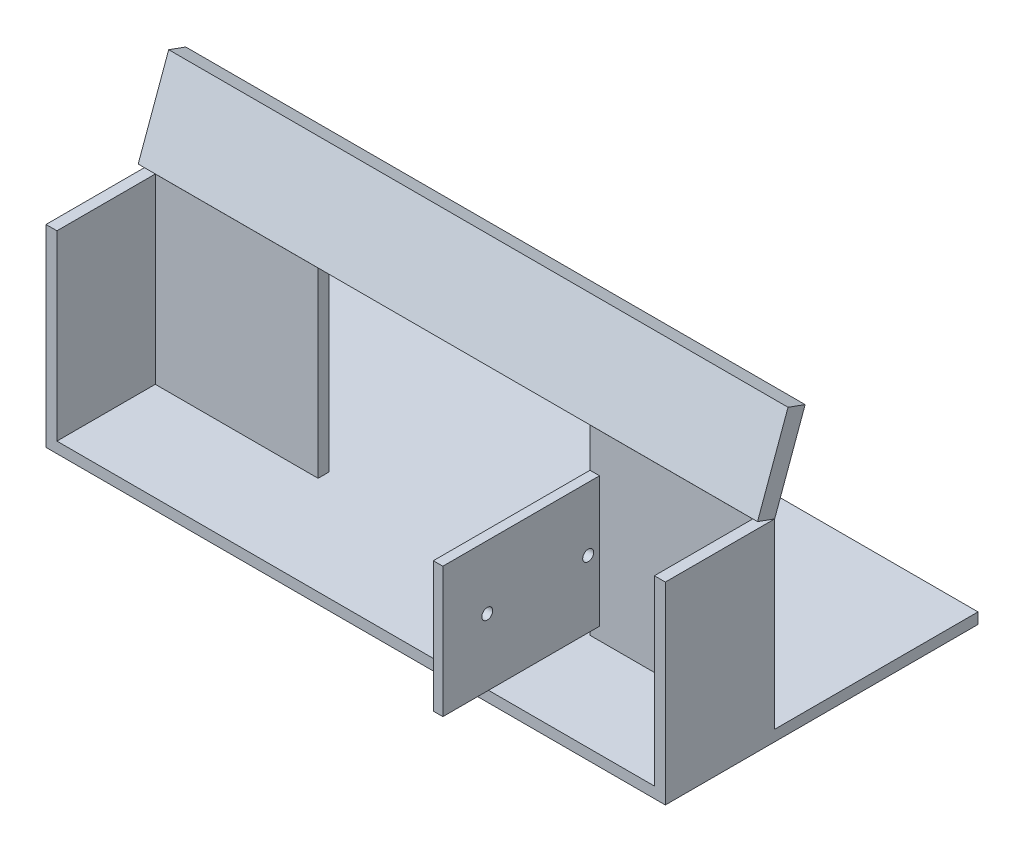
ISO-10303-21;
HEADER;
FILE_DESCRIPTION(('STEP AP214'),'2;1');
FILE_NAME('part.step','',(''),(''),'','','');
FILE_SCHEMA(('AUTOMOTIVE_DESIGN { 1 0 10303 214 1 1 1 1 }'));
ENDSEC;
DATA;
#1=APPLICATION_CONTEXT('core data for automotive mechanical design processes');
#2=APPLICATION_PROTOCOL_DEFINITION('international standard','automotive_design',2000,#1);
#3=PRODUCT_CONTEXT('',#1,'mechanical');
#4=PRODUCT('Part','Part','',(#3));
#5=PRODUCT_RELATED_PRODUCT_CATEGORY('part','',(#4));
#6=PRODUCT_DEFINITION_FORMATION('','',#4);
#7=PRODUCT_DEFINITION_CONTEXT('part definition',#1,'design');
#8=PRODUCT_DEFINITION('design','',#6,#7);
#9=PRODUCT_DEFINITION_SHAPE('','',#8);
#10=(LENGTH_UNIT() NAMED_UNIT(*) SI_UNIT(.MILLI.,.METRE.));
#11=(NAMED_UNIT(*) PLANE_ANGLE_UNIT() SI_UNIT($,.RADIAN.));
#12=(NAMED_UNIT(*) SI_UNIT($,.STERADIAN.) SOLID_ANGLE_UNIT());
#13=UNCERTAINTY_MEASURE_WITH_UNIT(LENGTH_MEASURE(1.E-05),#10,'distance_accuracy_value','');
#14=(GEOMETRIC_REPRESENTATION_CONTEXT(3) GLOBAL_UNCERTAINTY_ASSIGNED_CONTEXT((#13)) GLOBAL_UNIT_ASSIGNED_CONTEXT((#10,
#11,#12)) REPRESENTATION_CONTEXT('',''));
#15=CARTESIAN_POINT('',(0.,0.,0.));
#16=DIRECTION('',(0.,0.,1.));
#17=DIRECTION('',(1.,0.,0.));
#18=AXIS2_PLACEMENT_3D('',#15,#16,#17);
#19=CARTESIAN_POINT('',(85.,51.7101007166283,-10.3015368960705));
#20=DIRECTION('',(-1.,0.,0.));
#21=DIRECTION('',(0.,-1.,0.));
#22=AXIS2_PLACEMENT_3D('',#19,#20,#21);
#23=PLANE('',#22);
#24=DIRECTION('',(0.,0.939692620785908,-0.342020143325669));
#25=VECTOR('',#24,1.);
#26=CARTESIAN_POINT('',(85.,50.,-15.));
#27=LINE('',#26,#25);
#28=CARTESIAN_POINT('',(85.,50.,-15.));
#29=VERTEX_POINT('',#28);
#30=CARTESIAN_POINT('',(85.,72.9997961324536,-23.371241186404));
#31=VERTEX_POINT('',#30);
#32=EDGE_CURVE('E108',#29,#31,#27,.T.);
#33=ORIENTED_EDGE('',*,*,#32,.T.);
#34=DIRECTION('',(0.,-0.342020143325669,-0.939692620785908));
#35=VECTOR('',#34,1.);
#36=CARTESIAN_POINT('',(85.,72.9997961324536,-23.371241186404));
#37=LINE('',#36,#35);
#38=CARTESIAN_POINT('',(85.,74.7098968490819,-18.6727780824745));
#39=VERTEX_POINT('',#38);
#40=EDGE_CURVE('E100',#39,#31,#37,.T.);
#41=ORIENTED_EDGE('',*,*,#40,.F.);
#42=DIRECTION('',(0.,0.939692620785908,-0.342020143325669));
#43=VECTOR('',#42,1.);
#44=CARTESIAN_POINT('',(85.,51.7101007166283,-10.3015368960705));
#45=LINE('',#44,#43);
#46=CARTESIAN_POINT('',(85.,51.7101007166283,-10.3015368960705));
#47=VERTEX_POINT('',#46);
#48=EDGE_CURVE('E91',#47,#39,#45,.T.);
#49=ORIENTED_EDGE('',*,*,#48,.F.);
#50=DIRECTION('',(0.,-0.342020143325669,-0.939692620785908));
#51=VECTOR('',#50,1.);
#52=CARTESIAN_POINT('',(85.,51.7101007166283,-10.3015368960705));
#53=LINE('',#52,#51);
#54=EDGE_CURVE('E53',#47,#29,#53,.T.);
#55=ORIENTED_EDGE('',*,*,#54,.T.);
#56=EDGE_LOOP('',(#33,#41,#49,#55));
#57=FACE_BOUND('',#56,.T.);
#58=ADVANCED_FACE('F45',(#57),#23,.F.);
#59=CARTESIAN_POINT('',(-85.,51.7101007166283,-10.3015368960705));
#60=DIRECTION('',(1.,0.,0.));
#61=DIRECTION('',(0.,1.,0.));
#62=AXIS2_PLACEMENT_3D('',#59,#60,#61);
#63=PLANE('',#62);
#64=DIRECTION('',(0.,-0.939692620785908,0.34202014332567));
#65=VECTOR('',#64,1.);
#66=CARTESIAN_POINT('',(-85.,50.,-15.));
#67=LINE('',#66,#65);
#68=CARTESIAN_POINT('',(-85.,72.9997961324536,-23.371241186404));
#69=VERTEX_POINT('',#68);
#70=CARTESIAN_POINT('',(-85.,50.,-15.));
#71=VERTEX_POINT('',#70);
#72=EDGE_CURVE('E72',#69,#71,#67,.T.);
#73=ORIENTED_EDGE('',*,*,#72,.T.);
#74=DIRECTION('',(0.,-0.342020143325669,-0.939692620785908));
#75=VECTOR('',#74,1.);
#76=CARTESIAN_POINT('',(-85.,51.7101007166283,-10.3015368960705));
#77=LINE('',#76,#75);
#78=CARTESIAN_POINT('',(-85.,51.7101007166283,-10.3015368960705));
#79=VERTEX_POINT('',#78);
#80=EDGE_CURVE('E12',#79,#71,#77,.T.);
#81=ORIENTED_EDGE('',*,*,#80,.F.);
#82=DIRECTION('',(0.,-0.939692620785908,0.34202014332567));
#83=VECTOR('',#82,1.);
#84=CARTESIAN_POINT('',(-85.,51.7101007166283,-10.3015368960705));
#85=LINE('',#84,#83);
#86=CARTESIAN_POINT('',(-85.,74.7098968490819,-18.6727780824745));
#87=VERTEX_POINT('',#86);
#88=EDGE_CURVE('E86',#87,#79,#85,.T.);
#89=ORIENTED_EDGE('',*,*,#88,.F.);
#90=DIRECTION('',(0.,0.342020143325669,0.939692620785908));
#91=VECTOR('',#90,1.);
#92=CARTESIAN_POINT('',(-85.,72.9997961324536,-23.371241186404));
#93=LINE('',#92,#91);
#94=EDGE_CURVE('E90',#69,#87,#93,.T.);
#95=ORIENTED_EDGE('',*,*,#94,.F.);
#96=EDGE_LOOP('',(#73,#81,#89,#95));
#97=FACE_BOUND('',#96,.T.);
#98=ADVANCED_FACE('F88',(#97),#63,.F.);
#99=CARTESIAN_POINT('',(85.,51.7101007166283,-10.3015368960705));
#100=DIRECTION('',(0.,0.939692620785908,-0.342020143325669));
#101=DIRECTION('',(0.,0.342020143325669,0.939692620785908));
#102=AXIS2_PLACEMENT_3D('',#99,#100,#101);
#103=PLANE('',#102);
#104=DIRECTION('',(1.,0.,0.));
#105=VECTOR('',#104,1.);
#106=CARTESIAN_POINT('',(85.,50.,-15.));
#107=LINE('',#106,#105);
#108=EDGE_CURVE('E109',#71,#29,#107,.T.);
#109=ORIENTED_EDGE('',*,*,#108,.T.);
#110=ORIENTED_EDGE('',*,*,#54,.F.);
#111=DIRECTION('',(1.,0.,0.));
#112=VECTOR('',#111,1.);
#113=CARTESIAN_POINT('',(85.,51.7101007166283,-10.3015368960705));
#114=LINE('',#113,#112);
#115=EDGE_CURVE('E61',#79,#47,#114,.T.);
#116=ORIENTED_EDGE('',*,*,#115,.F.);
#117=ORIENTED_EDGE('',*,*,#80,.T.);
#118=EDGE_LOOP('',(#109,#110,#116,#117));
#119=FACE_BOUND('',#118,.T.);
#120=ADVANCED_FACE('F119',(#119),#103,.F.);
#121=CARTESIAN_POINT('',(0.,2.73808256600486,7.52282002270072));
#122=DIRECTION('',(0.,0.342020143325669,0.939692620785908));
#123=DIRECTION('',(0.,-0.939692620785908,0.342020143325669));
#124=AXIS2_PLACEMENT_3D('',#121,#122,#123);
#125=PLANE('',#124);
#126=ORIENTED_EDGE('',*,*,#48,.T.);
#127=DIRECTION('',(1.,0.,0.));
#128=VECTOR('',#127,1.);
#129=CARTESIAN_POINT('',(-85.,74.7098968490819,-18.6727780824745));
#130=LINE('',#129,#128);
#131=EDGE_CURVE('E94',#87,#39,#130,.T.);
#132=ORIENTED_EDGE('',*,*,#131,.F.);
#133=ORIENTED_EDGE('',*,*,#88,.T.);
#134=ORIENTED_EDGE('',*,*,#115,.T.);
#135=EDGE_LOOP('',(#126,#132,#133,#134));
#136=FACE_BOUND('',#135,.T.);
#137=ADVANCED_FACE('F95',(#136),#125,.T.);
#138=CARTESIAN_POINT('',(0.,1.02798184937652,2.82435691877117));
#139=DIRECTION('',(0.,0.342020143325669,0.939692620785908));
#140=DIRECTION('',(0.,-0.939692620785908,0.342020143325669));
#141=AXIS2_PLACEMENT_3D('',#138,#139,#140);
#142=PLANE('',#141);
#143=ORIENTED_EDGE('',*,*,#32,.F.);
#144=ORIENTED_EDGE('',*,*,#108,.F.);
#145=ORIENTED_EDGE('',*,*,#72,.F.);
#146=DIRECTION('',(-1.,0.,0.));
#147=VECTOR('',#146,1.);
#148=CARTESIAN_POINT('',(-85.,72.9997961324536,-23.371241186404));
#149=LINE('',#148,#147);
#150=EDGE_CURVE('E103',#31,#69,#149,.T.);
#151=ORIENTED_EDGE('',*,*,#150,.F.);
#152=EDGE_LOOP('',(#143,#144,#145,#151));
#153=FACE_BOUND('',#152,.T.);
#154=ADVANCED_FACE('F118',(#153),#142,.F.);
#155=CARTESIAN_POINT('',(0.,71.9718142830771,-26.1955981051752));
#156=DIRECTION('',(0.,0.939692620785908,-0.342020143325669));
#157=DIRECTION('',(0.,0.342020143325669,0.939692620785908));
#158=AXIS2_PLACEMENT_3D('',#155,#156,#157);
#159=PLANE('',#158);
#160=ORIENTED_EDGE('',*,*,#94,.T.);
#161=ORIENTED_EDGE('',*,*,#131,.T.);
#162=ORIENTED_EDGE('',*,*,#40,.T.);
#163=ORIENTED_EDGE('',*,*,#150,.T.);
#164=EDGE_LOOP('',(#160,#161,#162,#163));
#165=FACE_BOUND('',#164,.T.);
#166=ADVANCED_FACE('F102',(#165),#159,.T.);
#167=CLOSED_SHELL('',(#58,#98,#120,#137,#154,#166));
#168=MANIFOLD_SOLID_BREP('B2',#167);
#169=CARTESIAN_POINT('',(-82.,50.,-12.));
#170=DIRECTION('',(0.,0.,1.));
#171=DIRECTION('',(1.,0.,0.));
#172=AXIS2_PLACEMENT_3D('',#169,#170,#171);
#173=PLANE('',#172);
#174=DIRECTION('',(0.,1.,0.));
#175=VECTOR('',#174,1.);
#176=CARTESIAN_POINT('',(39.9314876820469,39.2302640315256,-12.));
#177=LINE('',#176,#175);
#178=CARTESIAN_POINT('',(39.9314876820469,3.46130785597865,-12.));
#179=VERTEX_POINT('',#178);
#180=CARTESIAN_POINT('',(39.9314876820469,39.2302640315256,-12.));
#181=VERTEX_POINT('',#180);
#182=EDGE_CURVE('E482',#179,#181,#177,.T.);
#183=ORIENTED_EDGE('',*,*,#182,.F.);
#184=DIRECTION('',(1.,0.,0.));
#185=VECTOR('',#184,1.);
#186=CARTESIAN_POINT('',(37.3162267650106,3.46130785597865,-12.));
#187=LINE('',#186,#185);
#188=CARTESIAN_POINT('',(37.3162267650106,3.46130785597865,-12.));
#189=VERTEX_POINT('',#188);
#190=EDGE_CURVE('E480',#189,#179,#187,.T.);
#191=ORIENTED_EDGE('',*,*,#190,.F.);
#192=DIRECTION('',(0.,1.,0.));
#193=VECTOR('',#192,1.);
#194=CARTESIAN_POINT('',(37.3162267650106,0.,-12.));
#195=LINE('',#194,#193);
#196=CARTESIAN_POINT('',(37.3162267650106,0.,-12.));
#197=VERTEX_POINT('',#196);
#198=EDGE_CURVE('E326',#197,#189,#195,.T.);
#199=ORIENTED_EDGE('',*,*,#198,.F.);
#200=DIRECTION('',(-1.,0.,0.));
#201=VECTOR('',#200,1.);
#202=CARTESIAN_POINT('',(-82.,0.,-12.));
#203=LINE('',#202,#201);
#204=CARTESIAN_POINT('',(82.,0.,-12.));
#205=VERTEX_POINT('',#204);
#206=EDGE_CURVE('E397',#205,#197,#203,.T.);
#207=ORIENTED_EDGE('',*,*,#206,.F.);
#208=DIRECTION('',(0.,-1.,0.));
#209=VECTOR('',#208,1.);
#210=CARTESIAN_POINT('',(82.,50.,-12.));
#211=LINE('',#210,#209);
#212=CARTESIAN_POINT('',(82.,50.,-12.));
#213=VERTEX_POINT('',#212);
#214=EDGE_CURVE('E404',#213,#205,#211,.T.);
#215=ORIENTED_EDGE('',*,*,#214,.F.);
#216=DIRECTION('',(-1.,0.,0.));
#217=VECTOR('',#216,1.);
#218=CARTESIAN_POINT('',(-82.,50.,-12.));
#219=LINE('',#218,#217);
#220=CARTESIAN_POINT('',(37.3162267650106,50.,-12.));
#221=VERTEX_POINT('',#220);
#222=EDGE_CURVE('E388',#213,#221,#219,.T.);
#223=ORIENTED_EDGE('',*,*,#222,.T.);
#224=CARTESIAN_POINT('',(37.3162267650106,39.2302640315256,-12.));
#225=VERTEX_POINT('',#224);
#226=EDGE_CURVE('E328',#225,#221,#195,.T.);
#227=ORIENTED_EDGE('',*,*,#226,.F.);
#228=DIRECTION('',(-1.,0.,0.));
#229=VECTOR('',#228,1.);
#230=CARTESIAN_POINT('',(37.3162267650106,39.2302640315256,-12.));
#231=LINE('',#230,#229);
#232=EDGE_CURVE('E321',#181,#225,#231,.T.);
#233=ORIENTED_EDGE('',*,*,#232,.F.);
#234=EDGE_LOOP('',(#183,#191,#199,#207,#215,#223,#227,#233));
#235=FACE_BOUND('',#234,.T.);
#236=ADVANCED_FACE('F181',(#235),#173,.T.);
#237=CARTESIAN_POINT('',(0.,50.,0.));
#238=DIRECTION('',(0.,-1.,0.));
#239=DIRECTION('',(0.,0.,-1.));
#240=AXIS2_PLACEMENT_3D('',#237,#238,#239);
#241=PLANE('',#240);
#242=CARTESIAN_POINT('',(-37.3162267650106,50.,-12.));
#243=VERTEX_POINT('',#242);
#244=CARTESIAN_POINT('',(-82.,50.,-12.));
#245=VERTEX_POINT('',#244);
#246=EDGE_CURVE('E386',#243,#245,#219,.T.);
#247=ORIENTED_EDGE('',*,*,#246,.F.);
#248=DIRECTION('',(0.,0.,1.));
#249=VECTOR('',#248,1.);
#250=CARTESIAN_POINT('',(-37.3162267650106,50.,-70.8174235094532));
#251=LINE('',#250,#249);
#252=CARTESIAN_POINT('',(-37.3162267650106,50.,-15.));
#253=VERTEX_POINT('',#252);
#254=EDGE_CURVE('E336',#253,#243,#251,.T.);
#255=ORIENTED_EDGE('',*,*,#254,.F.);
#256=DIRECTION('',(-1.,0.,0.));
#257=VECTOR('',#256,1.);
#258=CARTESIAN_POINT('',(-85.,50.,-15.));
#259=LINE('',#258,#257);
#260=CARTESIAN_POINT('',(-85.,50.,-15.));
#261=VERTEX_POINT('',#260);
#262=EDGE_CURVE('E411',#253,#261,#259,.T.);
#263=ORIENTED_EDGE('',*,*,#262,.T.);
#264=DIRECTION('',(0.,0.,1.));
#265=VECTOR('',#264,1.);
#266=CARTESIAN_POINT('',(-85.,50.,15.));
#267=LINE('',#266,#265);
#268=CARTESIAN_POINT('',(-85.,50.,15.));
#269=VERTEX_POINT('',#268);
#270=EDGE_CURVE('E416',#261,#269,#267,.T.);
#271=ORIENTED_EDGE('',*,*,#270,.T.);
#272=DIRECTION('',(1.,0.,0.));
#273=VECTOR('',#272,1.);
#274=CARTESIAN_POINT('',(-85.,50.,15.));
#275=LINE('',#274,#273);
#276=CARTESIAN_POINT('',(-82.,50.,15.));
#277=VERTEX_POINT('',#276);
#278=EDGE_CURVE('E419',#269,#277,#275,.T.);
#279=ORIENTED_EDGE('',*,*,#278,.T.);
#280=DIRECTION('',(0.,0.,1.));
#281=VECTOR('',#280,1.);
#282=CARTESIAN_POINT('',(-82.,50.,12.));
#283=LINE('',#282,#281);
#284=EDGE_CURVE('E391',#245,#277,#283,.T.);
#285=ORIENTED_EDGE('',*,*,#284,.F.);
#286=EDGE_LOOP('',(#247,#255,#263,#271,#279,#285));
#287=FACE_BOUND('',#286,.T.);
#288=ADVANCED_FACE('F460',(#287),#241,.F.);
#289=CARTESIAN_POINT('',(-85.,50.,-15.));
#290=DIRECTION('',(0.,0.,1.));
#291=DIRECTION('',(1.,0.,0.));
#292=AXIS2_PLACEMENT_3D('',#289,#290,#291);
#293=PLANE('',#292);
#294=ORIENTED_EDGE('',*,*,#262,.F.);
#295=DIRECTION('',(0.,-1.,0.));
#296=VECTOR('',#295,1.);
#297=CARTESIAN_POINT('',(-37.3162267650106,50.,-15.));
#298=LINE('',#297,#296);
#299=CARTESIAN_POINT('',(-37.3162267650106,0.,-15.));
#300=VERTEX_POINT('',#299);
#301=EDGE_CURVE('E347',#253,#300,#298,.T.);
#302=ORIENTED_EDGE('',*,*,#301,.T.);
#303=DIRECTION('',(-1.,0.,0.));
#304=VECTOR('',#303,1.);
#305=CARTESIAN_POINT('',(-85.,0.,-15.));
#306=LINE('',#305,#304);
#307=CARTESIAN_POINT('',(-85.,0.,-15.));
#308=VERTEX_POINT('',#307);
#309=EDGE_CURVE('E407',#300,#308,#306,.T.);
#310=ORIENTED_EDGE('',*,*,#309,.T.);
#311=DIRECTION('',(0.,-1.,0.));
#312=VECTOR('',#311,1.);
#313=CARTESIAN_POINT('',(-85.,50.,-15.));
#314=LINE('',#313,#312);
#315=EDGE_CURVE('E189',#261,#308,#314,.T.);
#316=ORIENTED_EDGE('',*,*,#315,.F.);
#317=EDGE_LOOP('',(#294,#302,#310,#316));
#318=FACE_BOUND('',#317,.T.);
#319=ADVANCED_FACE('F462',(#318),#293,.F.);
#320=DIRECTION('',(0.,-1.,0.));
#321=VECTOR('',#320,1.);
#322=CARTESIAN_POINT('',(-37.3162267650106,0.,-12.));
#323=LINE('',#322,#321);
#324=CARTESIAN_POINT('',(-37.3162267650106,0.,-12.));
#325=VERTEX_POINT('',#324);
#326=EDGE_CURVE('E204',#243,#325,#323,.T.);
#327=ORIENTED_EDGE('',*,*,#326,.F.);
#328=ORIENTED_EDGE('',*,*,#246,.T.);
#329=DIRECTION('',(0.,-1.,0.));
#330=VECTOR('',#329,1.);
#331=CARTESIAN_POINT('',(-82.,50.,-12.));
#332=LINE('',#331,#330);
#333=CARTESIAN_POINT('',(-82.,0.,-12.));
#334=VERTEX_POINT('',#333);
#335=EDGE_CURVE('E393',#245,#334,#332,.T.);
#336=ORIENTED_EDGE('',*,*,#335,.T.);
#337=EDGE_CURVE('E396',#325,#334,#203,.T.);
#338=ORIENTED_EDGE('',*,*,#337,.F.);
#339=EDGE_LOOP('',(#327,#328,#336,#338));
#340=FACE_BOUND('',#339,.T.);
#341=ADVANCED_FACE('F467',(#340),#173,.T.);
#342=CARTESIAN_POINT('',(85.,50.,-15.));
#343=VERTEX_POINT('',#342);
#344=CARTESIAN_POINT('',(37.3162267650106,50.,-15.));
#345=VERTEX_POINT('',#344);
#346=EDGE_CURVE('E413',#343,#345,#259,.T.);
#347=ORIENTED_EDGE('',*,*,#346,.T.);
#348=DIRECTION('',(0.,0.,1.));
#349=VECTOR('',#348,1.);
#350=CARTESIAN_POINT('',(37.3162267650106,50.,-70.8174235094532));
#351=LINE('',#350,#349);
#352=EDGE_CURVE('E339',#345,#221,#351,.T.);
#353=ORIENTED_EDGE('',*,*,#352,.T.);
#354=ORIENTED_EDGE('',*,*,#222,.F.);
#355=DIRECTION('',(0.,0.,-1.));
#356=VECTOR('',#355,1.);
#357=CARTESIAN_POINT('',(82.,50.,12.));
#358=LINE('',#357,#356);
#359=CARTESIAN_POINT('',(82.,50.,15.));
#360=VERTEX_POINT('',#359);
#361=EDGE_CURVE('E384',#360,#213,#358,.T.);
#362=ORIENTED_EDGE('',*,*,#361,.F.);
#363=CARTESIAN_POINT('',(85.,50.,15.));
#364=VERTEX_POINT('',#363);
#365=EDGE_CURVE('E418',#360,#364,#275,.T.);
#366=ORIENTED_EDGE('',*,*,#365,.T.);
#367=DIRECTION('',(0.,0.,-1.));
#368=VECTOR('',#367,1.);
#369=CARTESIAN_POINT('',(85.,50.,15.));
#370=LINE('',#369,#368);
#371=EDGE_CURVE('E408',#364,#343,#370,.T.);
#372=ORIENTED_EDGE('',*,*,#371,.T.);
#373=EDGE_LOOP('',(#347,#353,#354,#362,#366,#372));
#374=FACE_BOUND('',#373,.T.);
#375=ADVANCED_FACE('F500',(#374),#241,.F.);
#376=CARTESIAN_POINT('',(85.,50.,15.));
#377=DIRECTION('',(-1.,0.,0.));
#378=DIRECTION('',(0.,0.,1.));
#379=AXIS2_PLACEMENT_3D('',#376,#377,#378);
#380=PLANE('',#379);
#381=DIRECTION('',(0.,-1.,0.));
#382=VECTOR('',#381,1.);
#383=CARTESIAN_POINT('',(85.,50.,15.));
#384=LINE('',#383,#382);
#385=CARTESIAN_POINT('',(85.,-3.,15.));
#386=VERTEX_POINT('',#385);
#387=EDGE_CURVE('E422',#364,#386,#384,.T.);
#388=ORIENTED_EDGE('',*,*,#387,.T.);
#389=DIRECTION('',(0.,0.,1.));
#390=VECTOR('',#389,1.);
#391=CARTESIAN_POINT('',(85.,-3.,15.));
#392=LINE('',#391,#390);
#393=CARTESIAN_POINT('',(85.,-3.,-70.8174235094532));
#394=VERTEX_POINT('',#393);
#395=EDGE_CURVE('E357',#394,#386,#392,.T.);
#396=ORIENTED_EDGE('',*,*,#395,.F.);
#397=DIRECTION('',(0.,1.,0.));
#398=VECTOR('',#397,1.);
#399=CARTESIAN_POINT('',(85.,-3.,-70.8174235094532));
#400=LINE('',#399,#398);
#401=CARTESIAN_POINT('',(85.,0.,-70.8174235094532));
#402=VERTEX_POINT('',#401);
#403=EDGE_CURVE('E363',#394,#402,#400,.T.);
#404=ORIENTED_EDGE('',*,*,#403,.T.);
#405=DIRECTION('',(0.,0.,1.));
#406=VECTOR('',#405,1.);
#407=CARTESIAN_POINT('',(85.,0.,15.));
#408=LINE('',#407,#406);
#409=CARTESIAN_POINT('',(85.,0.,-15.));
#410=VERTEX_POINT('',#409);
#411=EDGE_CURVE('E367',#402,#410,#408,.T.);
#412=ORIENTED_EDGE('',*,*,#411,.T.);
#413=DIRECTION('',(0.,-1.,0.));
#414=VECTOR('',#413,1.);
#415=CARTESIAN_POINT('',(85.,50.,-15.));
#416=LINE('',#415,#414);
#417=EDGE_CURVE('E43',#343,#410,#416,.T.);
#418=ORIENTED_EDGE('',*,*,#417,.F.);
#419=ORIENTED_EDGE('',*,*,#371,.F.);
#420=EDGE_LOOP('',(#388,#396,#404,#412,#418,#419));
#421=FACE_BOUND('',#420,.T.);
#422=ADVANCED_FACE('F183',(#421),#380,.F.);
#423=CARTESIAN_POINT('',(37.3162267650106,0.,-15.));
#424=VERTEX_POINT('',#423);
#425=EDGE_CURVE('E412',#410,#424,#306,.T.);
#426=ORIENTED_EDGE('',*,*,#425,.T.);
#427=DIRECTION('',(0.,1.,0.));
#428=VECTOR('',#427,1.);
#429=CARTESIAN_POINT('',(37.3162267650106,50.,-15.));
#430=LINE('',#429,#428);
#431=EDGE_CURVE('E338',#424,#345,#430,.T.);
#432=ORIENTED_EDGE('',*,*,#431,.T.);
#433=ORIENTED_EDGE('',*,*,#346,.F.);
#434=ORIENTED_EDGE('',*,*,#417,.T.);
#435=EDGE_LOOP('',(#426,#432,#433,#434));
#436=FACE_BOUND('',#435,.T.);
#437=ADVANCED_FACE('F503',(#436),#293,.F.);
#438=CARTESIAN_POINT('',(-85.,50.,15.));
#439=DIRECTION('',(1.,0.,0.));
#440=DIRECTION('',(0.,0.,-1.));
#441=AXIS2_PLACEMENT_3D('',#438,#439,#440);
#442=PLANE('',#441);
#443=ORIENTED_EDGE('',*,*,#315,.T.);
#444=DIRECTION('',(0.,0.,-1.));
#445=VECTOR('',#444,1.);
#446=CARTESIAN_POINT('',(-85.,0.,15.));
#447=LINE('',#446,#445);
#448=CARTESIAN_POINT('',(-85.,0.,-70.8174235094532));
#449=VERTEX_POINT('',#448);
#450=EDGE_CURVE('E350',#308,#449,#447,.T.);
#451=ORIENTED_EDGE('',*,*,#450,.T.);
#452=DIRECTION('',(0.,1.,0.));
#453=VECTOR('',#452,1.);
#454=CARTESIAN_POINT('',(-85.,-3.,-70.8174235094532));
#455=LINE('',#454,#453);
#456=CARTESIAN_POINT('',(-85.,-3.,-70.8174235094532));
#457=VERTEX_POINT('',#456);
#458=EDGE_CURVE('E374',#457,#449,#455,.T.);
#459=ORIENTED_EDGE('',*,*,#458,.F.);
#460=DIRECTION('',(0.,0.,-1.));
#461=VECTOR('',#460,1.);
#462=CARTESIAN_POINT('',(-85.,-3.,15.));
#463=LINE('',#462,#461);
#464=CARTESIAN_POINT('',(-85.,-3.,15.));
#465=VERTEX_POINT('',#464);
#466=EDGE_CURVE('E351',#465,#457,#463,.T.);
#467=ORIENTED_EDGE('',*,*,#466,.F.);
#468=DIRECTION('',(0.,-1.,0.));
#469=VECTOR('',#468,1.);
#470=CARTESIAN_POINT('',(-85.,50.,15.));
#471=LINE('',#470,#469);
#472=EDGE_CURVE('E426',#269,#465,#471,.T.);
#473=ORIENTED_EDGE('',*,*,#472,.F.);
#474=ORIENTED_EDGE('',*,*,#270,.F.);
#475=EDGE_LOOP('',(#443,#451,#459,#467,#473,#474));
#476=FACE_BOUND('',#475,.T.);
#477=ADVANCED_FACE('F432',(#476),#442,.F.);
#478=CARTESIAN_POINT('',(-85.,50.,15.));
#479=DIRECTION('',(0.,0.,-1.));
#480=DIRECTION('',(-1.,0.,0.));
#481=AXIS2_PLACEMENT_3D('',#478,#479,#480);
#482=PLANE('',#481);
#483=ORIENTED_EDGE('',*,*,#365,.F.);
#484=DIRECTION('',(0.,1.,0.));
#485=VECTOR('',#484,1.);
#486=CARTESIAN_POINT('',(82.,0.,15.));
#487=LINE('',#486,#485);
#488=CARTESIAN_POINT('',(82.,0.,15.));
#489=VERTEX_POINT('',#488);
#490=EDGE_CURVE('E378',#489,#360,#487,.T.);
#491=ORIENTED_EDGE('',*,*,#490,.F.);
#492=DIRECTION('',(-1.,0.,0.));
#493=VECTOR('',#492,1.);
#494=CARTESIAN_POINT('',(-85.,0.,15.));
#495=LINE('',#494,#493);
#496=CARTESIAN_POINT('',(-82.,0.,15.));
#497=VERTEX_POINT('',#496);
#498=EDGE_CURVE('E355',#489,#497,#495,.T.);
#499=ORIENTED_EDGE('',*,*,#498,.T.);
#500=DIRECTION('',(0.,1.,0.));
#501=VECTOR('',#500,1.);
#502=CARTESIAN_POINT('',(-82.,0.,15.));
#503=LINE('',#502,#501);
#504=EDGE_CURVE('E377',#497,#277,#503,.T.);
#505=ORIENTED_EDGE('',*,*,#504,.T.);
#506=ORIENTED_EDGE('',*,*,#278,.F.);
#507=ORIENTED_EDGE('',*,*,#472,.T.);
#508=DIRECTION('',(-1.,0.,0.));
#509=VECTOR('',#508,1.);
#510=CARTESIAN_POINT('',(-85.,-3.,15.));
#511=LINE('',#510,#509);
#512=EDGE_CURVE('E360',#386,#465,#511,.T.);
#513=ORIENTED_EDGE('',*,*,#512,.F.);
#514=ORIENTED_EDGE('',*,*,#387,.F.);
#515=EDGE_LOOP('',(#483,#491,#499,#505,#506,#507,#513,#514));
#516=FACE_BOUND('',#515,.T.);
#517=ADVANCED_FACE('F455',(#516),#482,.F.);
#518=CARTESIAN_POINT('',(82.,50.,12.));
#519=DIRECTION('',(-1.,0.,0.));
#520=DIRECTION('',(0.,0.,1.));
#521=AXIS2_PLACEMENT_3D('',#518,#519,#520);
#522=PLANE('',#521);
#523=DIRECTION('',(0.,0.,-1.));
#524=VECTOR('',#523,1.);
#525=CARTESIAN_POINT('',(82.,0.,12.));
#526=LINE('',#525,#524);
#527=EDGE_CURVE('E381',#489,#205,#526,.T.);
#528=ORIENTED_EDGE('',*,*,#527,.F.);
#529=ORIENTED_EDGE('',*,*,#490,.T.);
#530=ORIENTED_EDGE('',*,*,#361,.T.);
#531=ORIENTED_EDGE('',*,*,#214,.T.);
#532=EDGE_LOOP('',(#528,#529,#530,#531));
#533=FACE_BOUND('',#532,.T.);
#534=ADVANCED_FACE('F474',(#533),#522,.T.);
#535=CARTESIAN_POINT('',(-82.,50.,12.));
#536=DIRECTION('',(1.,0.,0.));
#537=DIRECTION('',(0.,0.,-1.));
#538=AXIS2_PLACEMENT_3D('',#535,#536,#537);
#539=PLANE('',#538);
#540=DIRECTION('',(0.,0.,1.));
#541=VECTOR('',#540,1.);
#542=CARTESIAN_POINT('',(-82.,0.,12.));
#543=LINE('',#542,#541);
#544=EDGE_CURVE('E387',#334,#497,#543,.T.);
#545=ORIENTED_EDGE('',*,*,#544,.F.);
#546=ORIENTED_EDGE('',*,*,#335,.F.);
#547=ORIENTED_EDGE('',*,*,#284,.T.);
#548=ORIENTED_EDGE('',*,*,#504,.F.);
#549=EDGE_LOOP('',(#545,#546,#547,#548));
#550=FACE_BOUND('',#549,.T.);
#551=ADVANCED_FACE('F470',(#550),#539,.T.);
#552=CARTESIAN_POINT('',(0.,0.,0.));
#553=DIRECTION('',(0.,-1.,0.));
#554=DIRECTION('',(0.,0.,-1.));
#555=AXIS2_PLACEMENT_3D('',#552,#553,#554);
#556=PLANE('',#555);
#557=ORIENTED_EDGE('',*,*,#206,.T.);
#558=DIRECTION('',(0.,0.,1.));
#559=VECTOR('',#558,1.);
#560=CARTESIAN_POINT('',(37.3162267650106,0.,-70.8174235094532));
#561=LINE('',#560,#559);
#562=EDGE_CURVE('E342',#424,#197,#561,.T.);
#563=ORIENTED_EDGE('',*,*,#562,.F.);
#564=ORIENTED_EDGE('',*,*,#425,.F.);
#565=ORIENTED_EDGE('',*,*,#411,.F.);
#566=DIRECTION('',(1.,0.,0.));
#567=VECTOR('',#566,1.);
#568=CARTESIAN_POINT('',(-85.,0.,-70.8174235094532));
#569=LINE('',#568,#567);
#570=EDGE_CURVE('E365',#449,#402,#569,.T.);
#571=ORIENTED_EDGE('',*,*,#570,.F.);
#572=ORIENTED_EDGE('',*,*,#450,.F.);
#573=ORIENTED_EDGE('',*,*,#309,.F.);
#574=DIRECTION('',(0.,0.,1.));
#575=VECTOR('',#574,1.);
#576=CARTESIAN_POINT('',(-37.3162267650106,0.,-70.8174235094532));
#577=LINE('',#576,#575);
#578=EDGE_CURVE('E335',#300,#325,#577,.T.);
#579=ORIENTED_EDGE('',*,*,#578,.T.);
#580=ORIENTED_EDGE('',*,*,#337,.T.);
#581=ORIENTED_EDGE('',*,*,#544,.T.);
#582=ORIENTED_EDGE('',*,*,#498,.F.);
#583=ORIENTED_EDGE('',*,*,#527,.T.);
#584=EDGE_LOOP('',(#557,#563,#564,#565,#571,#572,#573,#579,#580,#581,#582,#583));
#585=FACE_BOUND('',#584,.T.);
#586=ADVANCED_FACE('F440',(#585),#556,.F.);
#587=CARTESIAN_POINT('',(-85.,-3.,-70.8174235094532));
#588=DIRECTION('',(0.,0.,1.));
#589=DIRECTION('',(1.,0.,0.));
#590=AXIS2_PLACEMENT_3D('',#587,#588,#589);
#591=PLANE('',#590);
#592=ORIENTED_EDGE('',*,*,#570,.T.);
#593=ORIENTED_EDGE('',*,*,#403,.F.);
#594=DIRECTION('',(1.,0.,0.));
#595=VECTOR('',#594,1.);
#596=CARTESIAN_POINT('',(-85.,-3.,-70.8174235094532));
#597=LINE('',#596,#595);
#598=EDGE_CURVE('E354',#457,#394,#597,.T.);
#599=ORIENTED_EDGE('',*,*,#598,.F.);
#600=ORIENTED_EDGE('',*,*,#458,.T.);
#601=EDGE_LOOP('',(#592,#593,#599,#600));
#602=FACE_BOUND('',#601,.T.);
#603=ADVANCED_FACE('F445',(#602),#591,.F.);
#604=CARTESIAN_POINT('',(0.,-3.,0.));
#605=DIRECTION('',(0.,-1.,0.));
#606=DIRECTION('',(0.,0.,-1.));
#607=AXIS2_PLACEMENT_3D('',#604,#605,#606);
#608=PLANE('',#607);
#609=ORIENTED_EDGE('',*,*,#466,.T.);
#610=ORIENTED_EDGE('',*,*,#598,.T.);
#611=ORIENTED_EDGE('',*,*,#395,.T.);
#612=ORIENTED_EDGE('',*,*,#512,.T.);
#613=EDGE_LOOP('',(#609,#610,#611,#612));
#614=FACE_BOUND('',#613,.T.);
#615=ADVANCED_FACE('F449',(#614),#608,.T.);
#616=CARTESIAN_POINT('',(-37.3162267650106,0.,-70.8174235094532));
#617=DIRECTION('',(-1.,0.,0.));
#618=DIRECTION('',(0.,0.,1.));
#619=AXIS2_PLACEMENT_3D('',#616,#617,#618);
#620=PLANE('',#619);
#621=ORIENTED_EDGE('',*,*,#254,.T.);
#622=ORIENTED_EDGE('',*,*,#326,.T.);
#623=ORIENTED_EDGE('',*,*,#578,.F.);
#624=ORIENTED_EDGE('',*,*,#301,.F.);
#625=EDGE_LOOP('',(#621,#622,#623,#624));
#626=FACE_BOUND('',#625,.T.);
#627=ADVANCED_FACE('F463',(#626),#620,.F.);
#628=CARTESIAN_POINT('',(37.3162267650106,0.,-70.8174235094532));
#629=DIRECTION('',(1.,0.,0.));
#630=DIRECTION('',(0.,0.,-1.));
#631=AXIS2_PLACEMENT_3D('',#628,#629,#630);
#632=PLANE('',#631);
#633=CARTESIAN_POINT('',(37.3162267650106,21.8365990301963,18.8152594955451));
#634=DIRECTION('',(1.,0.,0.));
#635=DIRECTION('',(0.,0.,-1.));
#636=AXIS2_PLACEMENT_3D('',#633,#634,#635);
#637=CIRCLE('',#636,1.5);
#638=CARTESIAN_POINT('',(37.3162267650106,21.8365990301963,17.3152594955451));
#639=VERTEX_POINT('',#638);
#640=EDGE_CURVE('E483',#639,#639,#637,.T.);
#641=ORIENTED_EDGE('',*,*,#640,.T.);
#642=EDGE_LOOP('',(#641));
#643=FACE_BOUND('',#642,.T.);
#644=CARTESIAN_POINT('',(37.3162267650106,21.8365990301963,-8.88474050445489));
#645=DIRECTION('',(1.,0.,0.));
#646=DIRECTION('',(0.,0.,-1.));
#647=AXIS2_PLACEMENT_3D('',#644,#645,#646);
#648=CIRCLE('',#647,1.5);
#649=CARTESIAN_POINT('',(37.3162267650106,21.8365990301963,-10.3847405044549));
#650=VERTEX_POINT('',#649);
#651=EDGE_CURVE('E487',#650,#650,#648,.T.);
#652=ORIENTED_EDGE('',*,*,#651,.T.);
#653=EDGE_LOOP('',(#652));
#654=FACE_BOUND('',#653,.T.);
#655=ORIENTED_EDGE('',*,*,#562,.T.);
#656=ORIENTED_EDGE('',*,*,#198,.T.);
#657=DIRECTION('',(0.,0.,-1.));
#658=VECTOR('',#657,1.);
#659=CARTESIAN_POINT('',(37.3162267650106,3.46130785597865,31.));
#660=LINE('',#659,#658);
#661=CARTESIAN_POINT('',(37.3162267650106,3.46130785597865,31.));
#662=VERTEX_POINT('',#661);
#663=EDGE_CURVE('E309',#662,#189,#660,.T.);
#664=ORIENTED_EDGE('',*,*,#663,.F.);
#665=DIRECTION('',(0.,-1.,0.));
#666=VECTOR('',#665,1.);
#667=CARTESIAN_POINT('',(37.3162267650106,39.2302640315256,31.));
#668=LINE('',#667,#666);
#669=CARTESIAN_POINT('',(37.3162267650106,39.2302640315256,31.));
#670=VERTEX_POINT('',#669);
#671=EDGE_CURVE('E316',#670,#662,#668,.T.);
#672=ORIENTED_EDGE('',*,*,#671,.F.);
#673=DIRECTION('',(0.,0.,-1.));
#674=VECTOR('',#673,1.);
#675=CARTESIAN_POINT('',(37.3162267650106,39.2302640315256,31.));
#676=LINE('',#675,#674);
#677=EDGE_CURVE('E196',#670,#225,#676,.T.);
#678=ORIENTED_EDGE('',*,*,#677,.T.);
#679=ORIENTED_EDGE('',*,*,#226,.T.);
#680=ORIENTED_EDGE('',*,*,#352,.F.);
#681=ORIENTED_EDGE('',*,*,#431,.F.);
#682=EDGE_LOOP('',(#655,#656,#664,#672,#678,#679,#680,#681));
#683=FACE_BOUND('',#682,.T.);
#684=ADVANCED_FACE('F324',(#643,#654,#683),#632,.F.);
#685=CARTESIAN_POINT('',(37.3162267650106,3.46130785597865,31.));
#686=DIRECTION('',(0.,1.,0.));
#687=DIRECTION('',(0.,0.,1.));
#688=AXIS2_PLACEMENT_3D('',#685,#686,#687);
#689=PLANE('',#688);
#690=ORIENTED_EDGE('',*,*,#190,.T.);
#691=DIRECTION('',(0.,0.,-1.));
#692=VECTOR('',#691,1.);
#693=CARTESIAN_POINT('',(39.9314876820469,3.46130785597865,31.));
#694=LINE('',#693,#692);
#695=CARTESIAN_POINT('',(39.9314876820469,3.46130785597865,31.));
#696=VERTEX_POINT('',#695);
#697=EDGE_CURVE('E312',#696,#179,#694,.T.);
#698=ORIENTED_EDGE('',*,*,#697,.F.);
#699=DIRECTION('',(1.,0.,0.));
#700=VECTOR('',#699,1.);
#701=CARTESIAN_POINT('',(37.3162267650106,3.46130785597865,31.));
#702=LINE('',#701,#700);
#703=EDGE_CURVE('E305',#662,#696,#702,.T.);
#704=ORIENTED_EDGE('',*,*,#703,.F.);
#705=ORIENTED_EDGE('',*,*,#663,.T.);
#706=EDGE_LOOP('',(#690,#698,#704,#705));
#707=FACE_BOUND('',#706,.T.);
#708=ADVANCED_FACE('F307',(#707),#689,.F.);
#709=CARTESIAN_POINT('',(39.9314876820469,39.2302640315256,31.));
#710=DIRECTION('',(-1.,0.,0.));
#711=DIRECTION('',(0.,-1.,0.));
#712=AXIS2_PLACEMENT_3D('',#709,#710,#711);
#713=PLANE('',#712);
#714=CARTESIAN_POINT('',(39.9314876820469,21.8365990301963,18.8152594955451));
#715=DIRECTION('',(1.,0.,0.));
#716=DIRECTION('',(0.,0.,-1.));
#717=AXIS2_PLACEMENT_3D('',#714,#715,#716);
#718=CIRCLE('',#717,1.5);
#719=CARTESIAN_POINT('',(39.9314876820469,21.8365990301963,17.3152594955451));
#720=VERTEX_POINT('',#719);
#721=EDGE_CURVE('E568',#720,#720,#718,.T.);
#722=ORIENTED_EDGE('',*,*,#721,.F.);
#723=EDGE_LOOP('',(#722));
#724=FACE_BOUND('',#723,.T.);
#725=CARTESIAN_POINT('',(39.9314876820469,21.8365990301963,-8.88474050445489));
#726=DIRECTION('',(1.,0.,0.));
#727=DIRECTION('',(0.,0.,-1.));
#728=AXIS2_PLACEMENT_3D('',#725,#726,#727);
#729=CIRCLE('',#728,1.5);
#730=CARTESIAN_POINT('',(39.9314876820469,21.8365990301963,-10.3847405044549));
#731=VERTEX_POINT('',#730);
#732=EDGE_CURVE('E575',#731,#731,#729,.T.);
#733=ORIENTED_EDGE('',*,*,#732,.F.);
#734=EDGE_LOOP('',(#733));
#735=FACE_BOUND('',#734,.T.);
#736=ORIENTED_EDGE('',*,*,#182,.T.);
#737=DIRECTION('',(0.,0.,-1.));
#738=VECTOR('',#737,1.);
#739=CARTESIAN_POINT('',(39.9314876820469,39.2302640315256,31.));
#740=LINE('',#739,#738);
#741=CARTESIAN_POINT('',(39.9314876820469,39.2302640315256,31.));
#742=VERTEX_POINT('',#741);
#743=EDGE_CURVE('E330',#742,#181,#740,.T.);
#744=ORIENTED_EDGE('',*,*,#743,.F.);
#745=DIRECTION('',(0.,1.,0.));
#746=VECTOR('',#745,1.);
#747=CARTESIAN_POINT('',(39.9314876820469,39.2302640315256,31.));
#748=LINE('',#747,#746);
#749=EDGE_CURVE('E315',#696,#742,#748,.T.);
#750=ORIENTED_EDGE('',*,*,#749,.F.);
#751=ORIENTED_EDGE('',*,*,#697,.T.);
#752=EDGE_LOOP('',(#736,#744,#750,#751));
#753=FACE_BOUND('',#752,.T.);
#754=ADVANCED_FACE('F548',(#724,#735,#753),#713,.F.);
#755=CARTESIAN_POINT('',(37.3162267650106,39.2302640315256,31.));
#756=DIRECTION('',(0.,-1.,0.));
#757=DIRECTION('',(0.,0.,-1.));
#758=AXIS2_PLACEMENT_3D('',#755,#756,#757);
#759=PLANE('',#758);
#760=ORIENTED_EDGE('',*,*,#232,.T.);
#761=ORIENTED_EDGE('',*,*,#677,.F.);
#762=DIRECTION('',(-1.,0.,0.));
#763=VECTOR('',#762,1.);
#764=CARTESIAN_POINT('',(37.3162267650106,39.2302640315256,31.));
#765=LINE('',#764,#763);
#766=EDGE_CURVE('E320',#742,#670,#765,.T.);
#767=ORIENTED_EDGE('',*,*,#766,.F.);
#768=ORIENTED_EDGE('',*,*,#743,.T.);
#769=EDGE_LOOP('',(#760,#761,#767,#768));
#770=FACE_BOUND('',#769,.T.);
#771=ADVANCED_FACE('F496',(#770),#759,.F.);
#772=CARTESIAN_POINT('',(0.,0.,31.));
#773=DIRECTION('',(0.,0.,1.));
#774=DIRECTION('',(1.,0.,0.));
#775=AXIS2_PLACEMENT_3D('',#772,#773,#774);
#776=PLANE('',#775);
#777=ORIENTED_EDGE('',*,*,#671,.T.);
#778=ORIENTED_EDGE('',*,*,#703,.T.);
#779=ORIENTED_EDGE('',*,*,#749,.T.);
#780=ORIENTED_EDGE('',*,*,#766,.T.);
#781=EDGE_LOOP('',(#777,#778,#779,#780));
#782=FACE_BOUND('',#781,.T.);
#783=ADVANCED_FACE('F318',(#782),#776,.T.);
#784=CARTESIAN_POINT('',(26.9314876820469,21.8365990301963,-8.88474050445489));
#785=DIRECTION('',(1.,0.,0.));
#786=DIRECTION('',(0.,0.,-1.));
#787=AXIS2_PLACEMENT_3D('',#784,#785,#786);
#788=CYLINDRICAL_SURFACE('',#787,1.5);
#789=ORIENTED_EDGE('',*,*,#732,.T.);
#790=EDGE_LOOP('',(#789));
#791=FACE_BOUND('',#790,.T.);
#792=ORIENTED_EDGE('',*,*,#651,.F.);
#793=EDGE_LOOP('',(#792));
#794=FACE_BOUND('',#793,.T.);
#795=ADVANCED_FACE('F556',(#791,#794),#788,.F.);
#796=CARTESIAN_POINT('',(26.9314876820469,21.8365990301963,18.8152594955451));
#797=DIRECTION('',(1.,0.,0.));
#798=DIRECTION('',(0.,0.,-1.));
#799=AXIS2_PLACEMENT_3D('',#796,#797,#798);
#800=CYLINDRICAL_SURFACE('',#799,1.5);
#801=ORIENTED_EDGE('',*,*,#721,.T.);
#802=EDGE_LOOP('',(#801));
#803=FACE_BOUND('',#802,.T.);
#804=ORIENTED_EDGE('',*,*,#640,.F.);
#805=EDGE_LOOP('',(#804));
#806=FACE_BOUND('',#805,.T.);
#807=ADVANCED_FACE('F559',(#803,#806),#800,.F.);
#808=CLOSED_SHELL('',(#236,#288,#319,#341,#375,#422,#437,#477,#517,#534,#551,#586,#603,#615,
#627,#684,#708,#754,#771,#783,#795,#807));
#809=MANIFOLD_SOLID_BREP('B6',#808);
#810=ADVANCED_BREP_SHAPE_REPRESENTATION('',(#18,#168,#809),#14);
#811=SHAPE_DEFINITION_REPRESENTATION(#9,#810);
ENDSEC;
END-ISO-10303-21;
